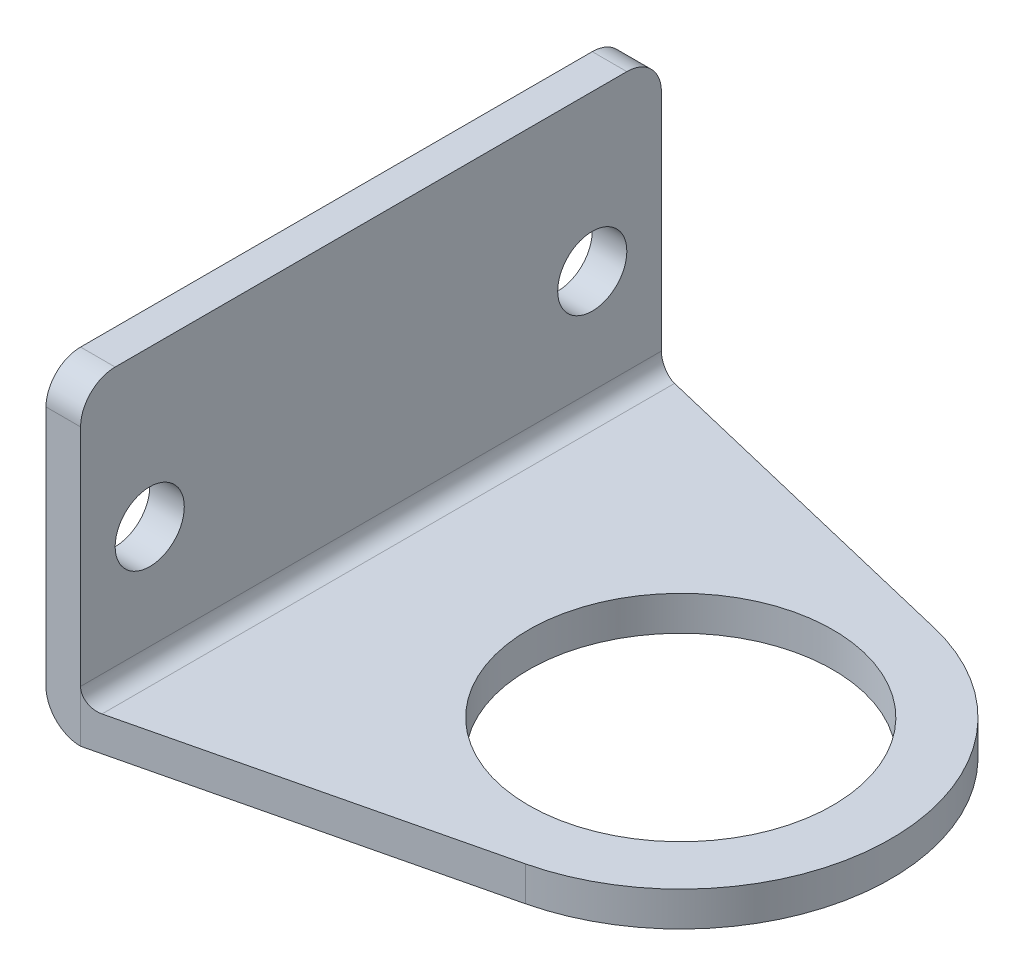
ISO-10303-21;
HEADER;
FILE_DESCRIPTION(('STEP AP214'),'2;1');
FILE_NAME('part.step','',(''),(''),'','','');
FILE_SCHEMA(('AUTOMOTIVE_DESIGN { 1 0 10303 214 1 1 1 1 }'));
ENDSEC;
DATA;
#1=APPLICATION_CONTEXT('core data for automotive mechanical design processes');
#2=APPLICATION_PROTOCOL_DEFINITION('international standard','automotive_design',2000,#1);
#3=PRODUCT_CONTEXT('',#1,'mechanical');
#4=PRODUCT('Part','Part','',(#3));
#5=PRODUCT_RELATED_PRODUCT_CATEGORY('part','',(#4));
#6=PRODUCT_DEFINITION_FORMATION('','',#4);
#7=PRODUCT_DEFINITION_CONTEXT('part definition',#1,'design');
#8=PRODUCT_DEFINITION('design','',#6,#7);
#9=PRODUCT_DEFINITION_SHAPE('','',#8);
#10=(LENGTH_UNIT() NAMED_UNIT(*) SI_UNIT(.MILLI.,.METRE.));
#11=(NAMED_UNIT(*) PLANE_ANGLE_UNIT() SI_UNIT($,.RADIAN.));
#12=(NAMED_UNIT(*) SI_UNIT($,.STERADIAN.) SOLID_ANGLE_UNIT());
#13=UNCERTAINTY_MEASURE_WITH_UNIT(LENGTH_MEASURE(1.E-05),#10,'distance_accuracy_value','');
#14=(GEOMETRIC_REPRESENTATION_CONTEXT(3) GLOBAL_UNCERTAINTY_ASSIGNED_CONTEXT((#13)) GLOBAL_UNIT_ASSIGNED_CONTEXT((#10,
#11,#12)) REPRESENTATION_CONTEXT('',''));
#15=CARTESIAN_POINT('',(0.,0.,0.));
#16=DIRECTION('',(0.,0.,1.));
#17=DIRECTION('',(1.,0.,0.));
#18=AXIS2_PLACEMENT_3D('',#15,#16,#17);
#19=CARTESIAN_POINT('',(0.,3.175,0.));
#20=DIRECTION('',(0.,1.,0.));
#21=DIRECTION('',(0.,0.,1.));
#22=AXIS2_PLACEMENT_3D('',#19,#20,#21);
#23=PLANE('',#22);
#24=CARTESIAN_POINT('',(0.,3.175,0.));
#25=DIRECTION('',(0.,1.,0.));
#26=DIRECTION('',(0.,0.,1.));
#27=AXIS2_PLACEMENT_3D('',#24,#25,#26);
#28=CIRCLE('',#27,13.97);
#29=CARTESIAN_POINT('',(0.,3.175,13.97));
#30=VERTEX_POINT('',#29);
#31=EDGE_CURVE('E205',#30,#30,#28,.T.);
#32=ORIENTED_EDGE('',*,*,#31,.F.);
#33=EDGE_LOOP('',(#32));
#34=FACE_BOUND('',#33,.T.);
#35=DIRECTION('',(0.972452174410427,0.,0.233102484938347));
#36=VECTOR('',#35,1.);
#37=CARTESIAN_POINT('',(4.49981036924985,3.175,-18.7722167748189));
#38=LINE('',#37,#36);
#39=CARTESIAN_POINT('',(-26.8605,3.175,-26.2894669469848));
#40=VERTEX_POINT('',#39);
#41=CARTESIAN_POINT('',(4.49981036924985,3.175,-18.7722167748189));
#42=VERTEX_POINT('',#41);
#43=EDGE_CURVE('E131',#40,#42,#38,.T.);
#44=ORIENTED_EDGE('',*,*,#43,.F.);
#45=DIRECTION('',(0.,0.,1.));
#46=VECTOR('',#45,1.);
#47=CARTESIAN_POINT('',(-26.8605,3.175,26.67));
#48=LINE('',#47,#46);
#49=CARTESIAN_POINT('',(-26.8605,3.175,26.2894669469848));
#50=VERTEX_POINT('',#49);
#51=EDGE_CURVE('E118',#40,#50,#48,.T.);
#52=ORIENTED_EDGE('',*,*,#51,.T.);
#53=DIRECTION('',(0.972452174410427,0.,-0.233102484938347));
#54=VECTOR('',#53,1.);
#55=CARTESIAN_POINT('',(4.49981036924985,3.175,18.7722167748189));
#56=LINE('',#55,#54);
#57=CARTESIAN_POINT('',(4.49981036924985,3.175,18.7722167748189));
#58=VERTEX_POINT('',#57);
#59=EDGE_CURVE('E112',#50,#58,#56,.T.);
#60=ORIENTED_EDGE('',*,*,#59,.T.);
#61=CARTESIAN_POINT('',(0.,3.175,0.));
#62=DIRECTION('',(0.,1.,0.));
#63=DIRECTION('',(0.,0.,1.));
#64=AXIS2_PLACEMENT_3D('',#61,#62,#63);
#65=CIRCLE('',#64,19.304);
#66=EDGE_CURVE('E115',#58,#42,#65,.T.);
#67=ORIENTED_EDGE('',*,*,#66,.T.);
#68=EDGE_LOOP('',(#44,#52,#60,#67));
#69=FACE_BOUND('',#68,.T.);
#70=ADVANCED_FACE('F34',(#34,#69),#23,.T.);
#71=CARTESIAN_POINT('',(4.49981036924985,3.175,18.7722167748189));
#72=DIRECTION('',(-0.233102484938347,0.,-0.972452174410427));
#73=DIRECTION('',(-0.972452174410427,0.,0.233102484938347));
#74=AXIS2_PLACEMENT_3D('',#71,#72,#73);
#75=PLANE('',#74);
#76=DIRECTION('',(0.972452174410427,0.,-0.233102484938347));
#77=VECTOR('',#76,1.);
#78=CARTESIAN_POINT('',(4.49981036924985,0.,18.7722167748189));
#79=LINE('',#78,#77);
#80=CARTESIAN_POINT('',(-28.448,0.,26.67));
#81=VERTEX_POINT('',#80);
#82=CARTESIAN_POINT('',(4.49981036924985,0.,18.7722167748189));
#83=VERTEX_POINT('',#82);
#84=EDGE_CURVE('E136',#81,#83,#79,.T.);
#85=ORIENTED_EDGE('',*,*,#84,.T.);
#86=DIRECTION('',(0.,-1.,0.));
#87=VECTOR('',#86,1.);
#88=CARTESIAN_POINT('',(4.49981036924985,3.175,18.7722167748189));
#89=LINE('',#88,#87);
#90=EDGE_CURVE('E128',#58,#83,#89,.T.);
#91=ORIENTED_EDGE('',*,*,#90,.F.);
#92=ORIENTED_EDGE('',*,*,#59,.F.);
#93=CARTESIAN_POINT('',(-26.8605,4.7625,26.2894669469848));
#94=DIRECTION('',(-0.233102484938347,0.,-0.972452174410427));
#95=DIRECTION('',(0.972452174410427,0.,-0.233102484938347));
#96=AXIS2_PLACEMENT_3D('',#93,#94,#95);
#97=ELLIPSE('',#96,1.63247102713556,1.5875);
#98=CARTESIAN_POINT('',(-28.448,4.7625,26.67));
#99=VERTEX_POINT('',#98);
#100=EDGE_CURVE('E154',#50,#99,#97,.T.);
#101=ORIENTED_EDGE('',*,*,#100,.T.);
#102=DIRECTION('',(0.,-1.,0.));
#103=VECTOR('',#102,1.);
#104=CARTESIAN_POINT('',(-28.448,3.175,26.67));
#105=LINE('',#104,#103);
#106=EDGE_CURVE('E198',#99,#81,#105,.T.);
#107=ORIENTED_EDGE('',*,*,#106,.T.);
#108=EDGE_LOOP('',(#85,#91,#92,#101,#107));
#109=FACE_BOUND('',#108,.T.);
#110=ADVANCED_FACE('F133',(#109),#75,.F.);
#111=CARTESIAN_POINT('',(0.,3.175,0.));
#112=DIRECTION('',(0.,-1.,0.));
#113=DIRECTION('',(0.,0.,-1.));
#114=AXIS2_PLACEMENT_3D('',#111,#112,#113);
#115=CYLINDRICAL_SURFACE('',#114,19.304);
#116=CARTESIAN_POINT('',(0.,0.,0.));
#117=DIRECTION('',(0.,1.,0.));
#118=DIRECTION('',(0.,0.,1.));
#119=AXIS2_PLACEMENT_3D('',#116,#117,#118);
#120=CIRCLE('',#119,19.304);
#121=CARTESIAN_POINT('',(4.49981036924985,0.,-18.7722167748189));
#122=VERTEX_POINT('',#121);
#123=EDGE_CURVE('E209',#83,#122,#120,.T.);
#124=ORIENTED_EDGE('',*,*,#123,.T.);
#125=DIRECTION('',(0.,-1.,0.));
#126=VECTOR('',#125,1.);
#127=CARTESIAN_POINT('',(4.49981036924985,3.175,-18.7722167748189));
#128=LINE('',#127,#126);
#129=EDGE_CURVE('E130',#42,#122,#128,.T.);
#130=ORIENTED_EDGE('',*,*,#129,.F.);
#131=ORIENTED_EDGE('',*,*,#66,.F.);
#132=ORIENTED_EDGE('',*,*,#90,.T.);
#133=EDGE_LOOP('',(#124,#130,#131,#132));
#134=FACE_BOUND('',#133,.T.);
#135=ADVANCED_FACE('F127',(#134),#115,.T.);
#136=CARTESIAN_POINT('',(4.49981036924985,3.175,-18.7722167748189));
#137=DIRECTION('',(0.233102484938347,0.,-0.972452174410427));
#138=DIRECTION('',(-0.972452174410427,0.,-0.233102484938347));
#139=AXIS2_PLACEMENT_3D('',#136,#137,#138);
#140=PLANE('',#139);
#141=DIRECTION('',(0.972452174410427,0.,0.233102484938347));
#142=VECTOR('',#141,1.);
#143=CARTESIAN_POINT('',(4.49981036924985,0.,-18.7722167748189));
#144=LINE('',#143,#142);
#145=CARTESIAN_POINT('',(-28.448,0.,-26.67));
#146=VERTEX_POINT('',#145);
#147=EDGE_CURVE('E211',#146,#122,#144,.T.);
#148=ORIENTED_EDGE('',*,*,#147,.F.);
#149=DIRECTION('',(0.,-1.,0.));
#150=VECTOR('',#149,1.);
#151=CARTESIAN_POINT('',(-28.448,3.175,-26.67));
#152=LINE('',#151,#150);
#153=CARTESIAN_POINT('',(-28.448,4.7625,-26.67));
#154=VERTEX_POINT('',#153);
#155=EDGE_CURVE('E140',#154,#146,#152,.T.);
#156=ORIENTED_EDGE('',*,*,#155,.F.);
#157=CARTESIAN_POINT('',(-26.8605,4.7625,-26.2894669469848));
#158=DIRECTION('',(0.233102484938347,0.,-0.972452174410427));
#159=DIRECTION('',(-0.972452174410427,0.,-0.233102484938347));
#160=AXIS2_PLACEMENT_3D('',#157,#158,#159);
#161=ELLIPSE('',#160,1.63247102713556,1.5875);
#162=EDGE_CURVE('E156',#154,#40,#161,.F.);
#163=ORIENTED_EDGE('',*,*,#162,.T.);
#164=ORIENTED_EDGE('',*,*,#43,.T.);
#165=ORIENTED_EDGE('',*,*,#129,.T.);
#166=EDGE_LOOP('',(#148,#156,#163,#164,#165));
#167=FACE_BOUND('',#166,.T.);
#168=ADVANCED_FACE('F228',(#167),#140,.T.);
#169=CARTESIAN_POINT('',(0.,3.175,-26.67));
#170=DIRECTION('',(0.,0.,1.));
#171=DIRECTION('',(1.,0.,0.));
#172=AXIS2_PLACEMENT_3D('',#169,#170,#171);
#173=PLANE('',#172);
#174=DIRECTION('',(0.,-1.,0.));
#175=VECTOR('',#174,1.);
#176=CARTESIAN_POINT('',(-31.623,3.175,-26.67));
#177=LINE('',#176,#175);
#178=CARTESIAN_POINT('',(-31.623,25.4,-26.67));
#179=VERTEX_POINT('',#178);
#180=CARTESIAN_POINT('',(-31.623,3.175,-26.67));
#181=VERTEX_POINT('',#180);
#182=EDGE_CURVE('E218',#179,#181,#177,.T.);
#183=ORIENTED_EDGE('',*,*,#182,.F.);
#184=DIRECTION('',(-1.,0.,0.));
#185=VECTOR('',#184,1.);
#186=CARTESIAN_POINT('',(-28.448,25.4,-26.67));
#187=LINE('',#186,#185);
#188=CARTESIAN_POINT('',(-28.448,25.4,-26.67));
#189=VERTEX_POINT('',#188);
#190=EDGE_CURVE('E11',#179,#189,#187,.F.);
#191=ORIENTED_EDGE('',*,*,#190,.T.);
#192=DIRECTION('',(0.,-1.,0.));
#193=VECTOR('',#192,1.);
#194=CARTESIAN_POINT('',(-28.448,28.575,-26.67));
#195=LINE('',#194,#193);
#196=EDGE_CURVE('E199',#189,#154,#195,.T.);
#197=ORIENTED_EDGE('',*,*,#196,.T.);
#198=ORIENTED_EDGE('',*,*,#155,.T.);
#199=CARTESIAN_POINT('',(-28.448,3.175,-26.67));
#200=DIRECTION('',(0.,0.,1.));
#201=DIRECTION('',(1.,0.,0.));
#202=AXIS2_PLACEMENT_3D('',#199,#200,#201);
#203=CIRCLE('',#202,3.175);
#204=EDGE_CURVE('E165',#146,#181,#203,.F.);
#205=ORIENTED_EDGE('',*,*,#204,.T.);
#206=EDGE_LOOP('',(#183,#191,#197,#198,#205));
#207=FACE_BOUND('',#206,.T.);
#208=ADVANCED_FACE('F223',(#207),#173,.F.);
#209=CARTESIAN_POINT('',(-31.623,3.175,0.));
#210=DIRECTION('',(1.,0.,0.));
#211=DIRECTION('',(0.,0.,-1.));
#212=AXIS2_PLACEMENT_3D('',#209,#210,#211);
#213=PLANE('',#212);
#214=CARTESIAN_POINT('',(-31.623,14.2875,-20.32));
#215=DIRECTION('',(-1.,0.,0.));
#216=DIRECTION('',(0.,0.,1.));
#217=AXIS2_PLACEMENT_3D('',#214,#215,#216);
#218=CIRCLE('',#217,3.175);
#219=CARTESIAN_POINT('',(-31.623,14.2875,-17.145));
#220=VERTEX_POINT('',#219);
#221=EDGE_CURVE('E148',#220,#220,#218,.T.);
#222=ORIENTED_EDGE('',*,*,#221,.F.);
#223=EDGE_LOOP('',(#222));
#224=FACE_BOUND('',#223,.T.);
#225=CARTESIAN_POINT('',(-31.623,14.2875,20.32));
#226=DIRECTION('',(-1.,0.,0.));
#227=DIRECTION('',(0.,0.,1.));
#228=AXIS2_PLACEMENT_3D('',#225,#226,#227);
#229=CIRCLE('',#228,3.175);
#230=CARTESIAN_POINT('',(-31.623,14.2875,23.495));
#231=VERTEX_POINT('',#230);
#232=EDGE_CURVE('E238',#231,#231,#229,.T.);
#233=ORIENTED_EDGE('',*,*,#232,.F.);
#234=EDGE_LOOP('',(#233));
#235=FACE_BOUND('',#234,.T.);
#236=DIRECTION('',(0.,-1.,0.));
#237=VECTOR('',#236,1.);
#238=CARTESIAN_POINT('',(-31.623,3.175,26.67));
#239=LINE('',#238,#237);
#240=CARTESIAN_POINT('',(-31.623,25.4,26.67));
#241=VERTEX_POINT('',#240);
#242=CARTESIAN_POINT('',(-31.623,3.175,26.67));
#243=VERTEX_POINT('',#242);
#244=EDGE_CURVE('E183',#241,#243,#239,.T.);
#245=ORIENTED_EDGE('',*,*,#244,.F.);
#246=CARTESIAN_POINT('',(-31.623,25.4,23.495));
#247=DIRECTION('',(1.,0.,0.));
#248=DIRECTION('',(0.,0.,-1.));
#249=AXIS2_PLACEMENT_3D('',#246,#247,#248);
#250=CIRCLE('',#249,3.175);
#251=CARTESIAN_POINT('',(-31.623,28.575,23.495));
#252=VERTEX_POINT('',#251);
#253=EDGE_CURVE('E42',#241,#252,#250,.F.);
#254=ORIENTED_EDGE('',*,*,#253,.T.);
#255=DIRECTION('',(0.,0.,1.));
#256=VECTOR('',#255,1.);
#257=CARTESIAN_POINT('',(-31.623,28.575,0.));
#258=LINE('',#257,#256);
#259=CARTESIAN_POINT('',(-31.623,28.575,-23.495));
#260=VERTEX_POINT('',#259);
#261=EDGE_CURVE('E182',#260,#252,#258,.T.);
#262=ORIENTED_EDGE('',*,*,#261,.F.);
#263=CARTESIAN_POINT('',(-31.623,25.4,-23.495));
#264=DIRECTION('',(1.,0.,0.));
#265=DIRECTION('',(0.,0.,-1.));
#266=AXIS2_PLACEMENT_3D('',#263,#264,#265);
#267=CIRCLE('',#266,3.175);
#268=EDGE_CURVE('E49',#260,#179,#267,.F.);
#269=ORIENTED_EDGE('',*,*,#268,.T.);
#270=ORIENTED_EDGE('',*,*,#182,.T.);
#271=DIRECTION('',(0.,0.,1.));
#272=VECTOR('',#271,1.);
#273=CARTESIAN_POINT('',(-31.623,3.175,0.));
#274=LINE('',#273,#272);
#275=EDGE_CURVE('E158',#181,#243,#274,.T.);
#276=ORIENTED_EDGE('',*,*,#275,.T.);
#277=EDGE_LOOP('',(#245,#254,#262,#269,#270,#276));
#278=FACE_BOUND('',#277,.T.);
#279=ADVANCED_FACE('F181',(#224,#235,#278),#213,.F.);
#280=CARTESIAN_POINT('',(0.,3.175,26.67));
#281=DIRECTION('',(0.,0.,1.));
#282=DIRECTION('',(1.,0.,0.));
#283=AXIS2_PLACEMENT_3D('',#280,#281,#282);
#284=PLANE('',#283);
#285=DIRECTION('',(0.,-1.,0.));
#286=VECTOR('',#285,1.);
#287=CARTESIAN_POINT('',(-28.448,28.575,26.67));
#288=LINE('',#287,#286);
#289=CARTESIAN_POINT('',(-28.448,25.4,26.67));
#290=VERTEX_POINT('',#289);
#291=EDGE_CURVE('E191',#290,#99,#288,.T.);
#292=ORIENTED_EDGE('',*,*,#291,.F.);
#293=DIRECTION('',(1.,0.,0.));
#294=VECTOR('',#293,1.);
#295=CARTESIAN_POINT('',(0.,25.4,26.67));
#296=LINE('',#295,#294);
#297=EDGE_CURVE('E57',#290,#241,#296,.F.);
#298=ORIENTED_EDGE('',*,*,#297,.T.);
#299=ORIENTED_EDGE('',*,*,#244,.T.);
#300=CARTESIAN_POINT('',(-28.448,3.175,26.67));
#301=DIRECTION('',(0.,0.,1.));
#302=DIRECTION('',(1.,0.,0.));
#303=AXIS2_PLACEMENT_3D('',#300,#301,#302);
#304=CIRCLE('',#303,3.175);
#305=EDGE_CURVE('E161',#243,#81,#304,.T.);
#306=ORIENTED_EDGE('',*,*,#305,.T.);
#307=ORIENTED_EDGE('',*,*,#106,.F.);
#308=EDGE_LOOP('',(#292,#298,#299,#306,#307));
#309=FACE_BOUND('',#308,.T.);
#310=ADVANCED_FACE('F197',(#309),#284,.T.);
#311=CARTESIAN_POINT('',(0.,3.175,0.));
#312=DIRECTION('',(0.,-1.,0.));
#313=DIRECTION('',(0.,0.,-1.));
#314=AXIS2_PLACEMENT_3D('',#311,#312,#313);
#315=CYLINDRICAL_SURFACE('',#314,13.97);
#316=ORIENTED_EDGE('',*,*,#31,.T.);
#317=EDGE_LOOP('',(#316));
#318=FACE_BOUND('',#317,.T.);
#319=CARTESIAN_POINT('',(0.,0.,0.));
#320=DIRECTION('',(0.,1.,0.));
#321=DIRECTION('',(0.,0.,1.));
#322=AXIS2_PLACEMENT_3D('',#319,#320,#321);
#323=CIRCLE('',#322,13.97);
#324=CARTESIAN_POINT('',(0.,0.,13.97));
#325=VERTEX_POINT('',#324);
#326=EDGE_CURVE('E122',#325,#325,#323,.T.);
#327=ORIENTED_EDGE('',*,*,#326,.F.);
#328=EDGE_LOOP('',(#327));
#329=FACE_BOUND('',#328,.T.);
#330=ADVANCED_FACE('F276',(#318,#329),#315,.F.);
#331=CARTESIAN_POINT('',(0.,0.,0.));
#332=DIRECTION('',(0.,1.,0.));
#333=DIRECTION('',(0.,0.,1.));
#334=AXIS2_PLACEMENT_3D('',#331,#332,#333);
#335=PLANE('',#334);
#336=ORIENTED_EDGE('',*,*,#84,.F.);
#337=DIRECTION('',(0.,0.,1.));
#338=VECTOR('',#337,1.);
#339=CARTESIAN_POINT('',(-28.448,0.,0.));
#340=LINE('',#339,#338);
#341=EDGE_CURVE('E163',#81,#146,#340,.F.);
#342=ORIENTED_EDGE('',*,*,#341,.T.);
#343=ORIENTED_EDGE('',*,*,#147,.T.);
#344=ORIENTED_EDGE('',*,*,#123,.F.);
#345=EDGE_LOOP('',(#336,#342,#343,#344));
#346=FACE_BOUND('',#345,.T.);
#347=ORIENTED_EDGE('',*,*,#326,.T.);
#348=EDGE_LOOP('',(#347));
#349=FACE_BOUND('',#348,.T.);
#350=ADVANCED_FACE('F273',(#346,#349),#335,.F.);
#351=CARTESIAN_POINT('',(-28.448,28.575,0.));
#352=DIRECTION('',(1.,0.,0.));
#353=DIRECTION('',(0.,0.,-1.));
#354=AXIS2_PLACEMENT_3D('',#351,#352,#353);
#355=PLANE('',#354);
#356=CARTESIAN_POINT('',(-28.448,14.2875,-20.32));
#357=DIRECTION('',(1.,0.,0.));
#358=DIRECTION('',(0.,0.,-1.));
#359=AXIS2_PLACEMENT_3D('',#356,#357,#358);
#360=CIRCLE('',#359,3.175);
#361=CARTESIAN_POINT('',(-28.448,14.2875,-23.495));
#362=VERTEX_POINT('',#361);
#363=EDGE_CURVE('E147',#362,#362,#360,.T.);
#364=ORIENTED_EDGE('',*,*,#363,.F.);
#365=EDGE_LOOP('',(#364));
#366=FACE_BOUND('',#365,.T.);
#367=CARTESIAN_POINT('',(-28.448,14.2875,20.32));
#368=DIRECTION('',(1.,0.,0.));
#369=DIRECTION('',(0.,0.,-1.));
#370=AXIS2_PLACEMENT_3D('',#367,#368,#369);
#371=CIRCLE('',#370,3.175);
#372=CARTESIAN_POINT('',(-28.448,14.2875,17.145));
#373=VERTEX_POINT('',#372);
#374=EDGE_CURVE('E144',#373,#373,#371,.T.);
#375=ORIENTED_EDGE('',*,*,#374,.F.);
#376=EDGE_LOOP('',(#375));
#377=FACE_BOUND('',#376,.T.);
#378=DIRECTION('',(0.,0.,1.));
#379=VECTOR('',#378,1.);
#380=CARTESIAN_POINT('',(-28.448,28.575,0.));
#381=LINE('',#380,#379);
#382=CARTESIAN_POINT('',(-28.448,28.575,-23.495));
#383=VERTEX_POINT('',#382);
#384=CARTESIAN_POINT('',(-28.448,28.575,23.495));
#385=VERTEX_POINT('',#384);
#386=EDGE_CURVE('E150',#383,#385,#381,.T.);
#387=ORIENTED_EDGE('',*,*,#386,.T.);
#388=CARTESIAN_POINT('',(-28.448,25.4,23.495));
#389=DIRECTION('',(1.,0.,0.));
#390=DIRECTION('',(0.,0.,-1.));
#391=AXIS2_PLACEMENT_3D('',#388,#389,#390);
#392=CIRCLE('',#391,3.175);
#393=EDGE_CURVE('E176',#385,#290,#392,.T.);
#394=ORIENTED_EDGE('',*,*,#393,.T.);
#395=ORIENTED_EDGE('',*,*,#291,.T.);
#396=DIRECTION('',(0.,0.,1.));
#397=VECTOR('',#396,1.);
#398=CARTESIAN_POINT('',(-28.448,4.7625,-26.67));
#399=LINE('',#398,#397);
#400=EDGE_CURVE('E138',#99,#154,#399,.F.);
#401=ORIENTED_EDGE('',*,*,#400,.T.);
#402=ORIENTED_EDGE('',*,*,#196,.F.);
#403=CARTESIAN_POINT('',(-28.448,25.4,-23.495));
#404=DIRECTION('',(1.,0.,0.));
#405=DIRECTION('',(0.,0.,-1.));
#406=AXIS2_PLACEMENT_3D('',#403,#404,#405);
#407=CIRCLE('',#406,3.175);
#408=EDGE_CURVE('E174',#189,#383,#407,.T.);
#409=ORIENTED_EDGE('',*,*,#408,.T.);
#410=EDGE_LOOP('',(#387,#394,#395,#401,#402,#409));
#411=FACE_BOUND('',#410,.T.);
#412=ADVANCED_FACE('F195',(#366,#377,#411),#355,.T.);
#413=CARTESIAN_POINT('',(0.,28.575,0.));
#414=DIRECTION('',(0.,1.,0.));
#415=DIRECTION('',(0.,0.,1.));
#416=AXIS2_PLACEMENT_3D('',#413,#414,#415);
#417=PLANE('',#416);
#418=ORIENTED_EDGE('',*,*,#261,.T.);
#419=DIRECTION('',(1.,0.,0.));
#420=VECTOR('',#419,1.);
#421=CARTESIAN_POINT('',(0.,28.575,23.495));
#422=LINE('',#421,#420);
#423=EDGE_CURVE('E171',#252,#385,#422,.T.);
#424=ORIENTED_EDGE('',*,*,#423,.T.);
#425=ORIENTED_EDGE('',*,*,#386,.F.);
#426=DIRECTION('',(-1.,0.,0.));
#427=VECTOR('',#426,1.);
#428=CARTESIAN_POINT('',(-31.623,28.575,-23.495));
#429=LINE('',#428,#427);
#430=EDGE_CURVE('E168',#383,#260,#429,.T.);
#431=ORIENTED_EDGE('',*,*,#430,.T.);
#432=EDGE_LOOP('',(#418,#424,#425,#431));
#433=FACE_BOUND('',#432,.T.);
#434=ADVANCED_FACE('F187',(#433),#417,.T.);
#435=CARTESIAN_POINT('',(19.304,14.2875,20.32));
#436=DIRECTION('',(-1.,0.,0.));
#437=DIRECTION('',(0.,0.,1.));
#438=AXIS2_PLACEMENT_3D('',#435,#436,#437);
#439=CYLINDRICAL_SURFACE('',#438,3.175);
#440=ORIENTED_EDGE('',*,*,#374,.T.);
#441=EDGE_LOOP('',(#440));
#442=FACE_BOUND('',#441,.T.);
#443=ORIENTED_EDGE('',*,*,#232,.T.);
#444=EDGE_LOOP('',(#443));
#445=FACE_BOUND('',#444,.T.);
#446=ADVANCED_FACE('F251',(#442,#445),#439,.F.);
#447=CARTESIAN_POINT('',(19.304,14.2875,-20.32));
#448=DIRECTION('',(-1.,0.,0.));
#449=DIRECTION('',(0.,0.,1.));
#450=AXIS2_PLACEMENT_3D('',#447,#448,#449);
#451=CYLINDRICAL_SURFACE('',#450,3.175);
#452=ORIENTED_EDGE('',*,*,#363,.T.);
#453=EDGE_LOOP('',(#452));
#454=FACE_BOUND('',#453,.T.);
#455=ORIENTED_EDGE('',*,*,#221,.T.);
#456=EDGE_LOOP('',(#455));
#457=FACE_BOUND('',#456,.T.);
#458=ADVANCED_FACE('F244',(#454,#457),#451,.F.);
#459=CARTESIAN_POINT('',(-26.8605,4.7625,0.));
#460=DIRECTION('',(0.,0.,-1.));
#461=DIRECTION('',(-1.,0.,0.));
#462=AXIS2_PLACEMENT_3D('',#459,#460,#461);
#463=CYLINDRICAL_SURFACE('',#462,1.5875);
#464=ORIENTED_EDGE('',*,*,#162,.F.);
#465=ORIENTED_EDGE('',*,*,#400,.F.);
#466=ORIENTED_EDGE('',*,*,#100,.F.);
#467=ORIENTED_EDGE('',*,*,#51,.F.);
#468=EDGE_LOOP('',(#464,#465,#466,#467));
#469=FACE_BOUND('',#468,.T.);
#470=ADVANCED_FACE('F259',(#469),#463,.F.);
#471=CARTESIAN_POINT('',(-28.448,3.175,0.));
#472=DIRECTION('',(0.,0.,1.));
#473=DIRECTION('',(1.,0.,0.));
#474=AXIS2_PLACEMENT_3D('',#471,#472,#473);
#475=CYLINDRICAL_SURFACE('',#474,3.175);
#476=ORIENTED_EDGE('',*,*,#204,.F.);
#477=ORIENTED_EDGE('',*,*,#341,.F.);
#478=ORIENTED_EDGE('',*,*,#305,.F.);
#479=ORIENTED_EDGE('',*,*,#275,.F.);
#480=EDGE_LOOP('',(#476,#477,#478,#479));
#481=FACE_BOUND('',#480,.T.);
#482=ADVANCED_FACE('F232',(#481),#475,.T.);
#483=CARTESIAN_POINT('',(0.,25.4,23.495));
#484=DIRECTION('',(1.,0.,0.));
#485=DIRECTION('',(0.,0.,-1.));
#486=AXIS2_PLACEMENT_3D('',#483,#484,#485);
#487=CYLINDRICAL_SURFACE('',#486,3.175);
#488=ORIENTED_EDGE('',*,*,#253,.F.);
#489=ORIENTED_EDGE('',*,*,#297,.F.);
#490=ORIENTED_EDGE('',*,*,#393,.F.);
#491=ORIENTED_EDGE('',*,*,#423,.F.);
#492=EDGE_LOOP('',(#488,#489,#490,#491));
#493=FACE_BOUND('',#492,.T.);
#494=ADVANCED_FACE('F193',(#493),#487,.T.);
#495=CARTESIAN_POINT('',(0.,25.4,-23.495));
#496=DIRECTION('',(1.,0.,0.));
#497=DIRECTION('',(0.,0.,-1.));
#498=AXIS2_PLACEMENT_3D('',#495,#496,#497);
#499=CYLINDRICAL_SURFACE('',#498,3.175);
#500=ORIENTED_EDGE('',*,*,#408,.F.);
#501=ORIENTED_EDGE('',*,*,#190,.F.);
#502=ORIENTED_EDGE('',*,*,#268,.F.);
#503=ORIENTED_EDGE('',*,*,#430,.F.);
#504=EDGE_LOOP('',(#500,#501,#502,#503));
#505=FACE_BOUND('',#504,.T.);
#506=ADVANCED_FACE('F36',(#505),#499,.T.);
#507=CLOSED_SHELL('',(#70,#110,#135,#168,#208,#279,#310,#330,#350,#412,#434,#446,#458,#470,#482,
#494,#506));
#508=MANIFOLD_SOLID_BREP('B2',#507);
#509=ADVANCED_BREP_SHAPE_REPRESENTATION('',(#18,#508),#14);
#510=SHAPE_DEFINITION_REPRESENTATION(#9,#509);
ENDSEC;
END-ISO-10303-21;
